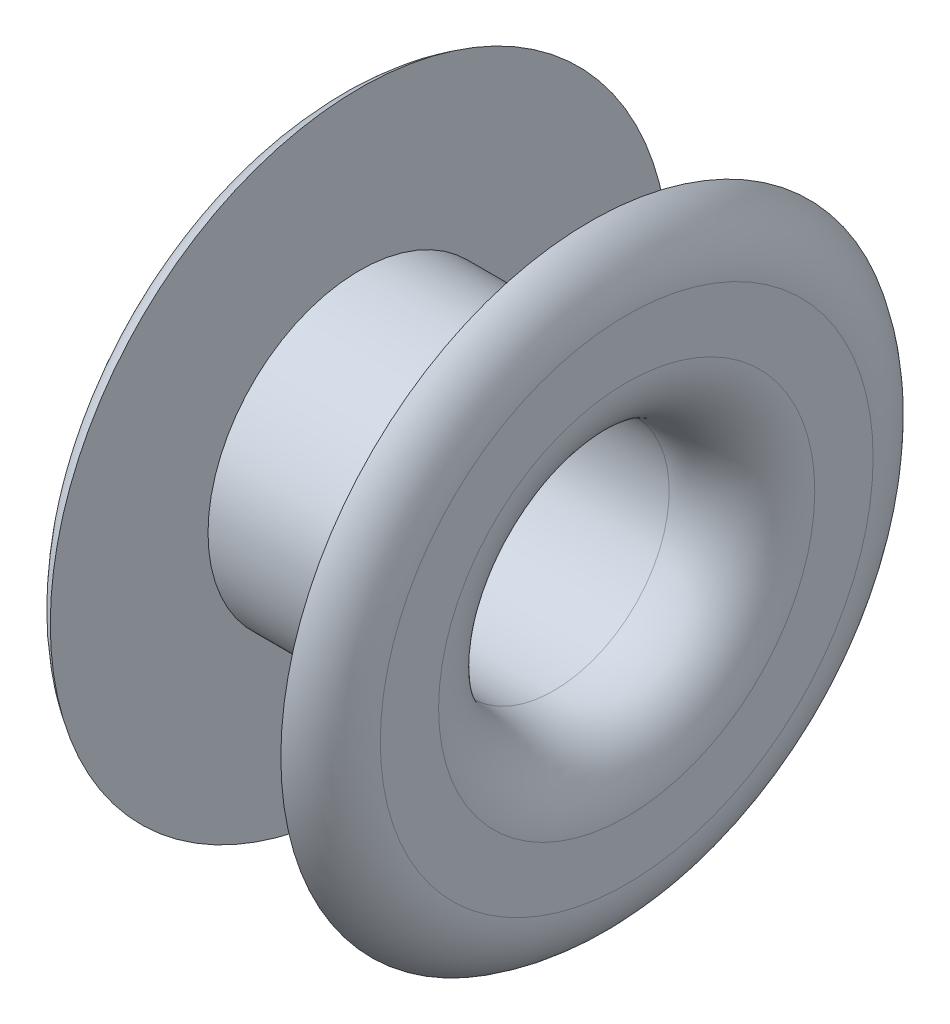
ISO-10303-21;
HEADER;
FILE_DESCRIPTION(('STEP AP214'),'2;1');
FILE_NAME('part.step','',(''),(''),'','','');
FILE_SCHEMA(('AUTOMOTIVE_DESIGN { 1 0 10303 214 1 1 1 1 }'));
ENDSEC;
DATA;
#1=APPLICATION_CONTEXT('core data for automotive mechanical design processes');
#2=APPLICATION_PROTOCOL_DEFINITION('international standard','automotive_design',2000,#1);
#3=PRODUCT_CONTEXT('',#1,'mechanical');
#4=PRODUCT('Part','Part','',(#3));
#5=PRODUCT_RELATED_PRODUCT_CATEGORY('part','',(#4));
#6=PRODUCT_DEFINITION_FORMATION('','',#4);
#7=PRODUCT_DEFINITION_CONTEXT('part definition',#1,'design');
#8=PRODUCT_DEFINITION('design','',#6,#7);
#9=PRODUCT_DEFINITION_SHAPE('','',#8);
#10=(LENGTH_UNIT() NAMED_UNIT(*) SI_UNIT(.MILLI.,.METRE.));
#11=(NAMED_UNIT(*) PLANE_ANGLE_UNIT() SI_UNIT($,.RADIAN.));
#12=(NAMED_UNIT(*) SI_UNIT($,.STERADIAN.) SOLID_ANGLE_UNIT());
#13=UNCERTAINTY_MEASURE_WITH_UNIT(LENGTH_MEASURE(1.E-05),#10,'distance_accuracy_value','');
#14=(GEOMETRIC_REPRESENTATION_CONTEXT(3) GLOBAL_UNCERTAINTY_ASSIGNED_CONTEXT((#13)) GLOBAL_UNIT_ASSIGNED_CONTEXT((#10,
#11,#12)) REPRESENTATION_CONTEXT('',''));
#15=CARTESIAN_POINT('',(0.,0.,0.));
#16=DIRECTION('',(0.,0.,1.));
#17=DIRECTION('',(1.,0.,0.));
#18=AXIS2_PLACEMENT_3D('',#15,#16,#17);
#19=CARTESIAN_POINT('',(-0.65,0.,0.));
#20=DIRECTION('',(-1.,0.,0.));
#21=DIRECTION('',(0.,0.,1.));
#22=AXIS2_PLACEMENT_3D('',#19,#20,#21);
#23=TOROIDAL_SURFACE('',#22,2.03038475772934,0.6);
#24=CARTESIAN_POINT('',(-1.25,0.,0.));
#25=DIRECTION('',(-1.,0.,0.));
#26=DIRECTION('',(0.,0.,-1.));
#27=AXIS2_PLACEMENT_3D('',#24,#25,#26);
#28=CIRCLE('',#27,2.03038475772934);
#29=CARTESIAN_POINT('',(-1.25,0.,-2.03038475772934));
#30=VERTEX_POINT('',#29);
#31=EDGE_CURVE('E74',#30,#30,#28,.T.);
#32=ORIENTED_EDGE('',*,*,#31,.F.);
#33=EDGE_LOOP('',(#32));
#34=FACE_BOUND('',#33,.T.);
#35=CARTESIAN_POINT('',(-0.95,0.,0.));
#36=DIRECTION('',(-1.,0.,0.));
#37=DIRECTION('',(0.,0.,1.));
#38=AXIS2_PLACEMENT_3D('',#35,#36,#37);
#39=CIRCLE('',#38,2.55);
#40=CARTESIAN_POINT('',(-0.95,0.,2.55));
#41=VERTEX_POINT('',#40);
#42=EDGE_CURVE('E75',#41,#41,#39,.T.);
#43=ORIENTED_EDGE('',*,*,#42,.T.);
#44=EDGE_LOOP('',(#43));
#45=FACE_BOUND('',#44,.T.);
#46=ADVANCED_FACE('F16',(#34,#45),#23,.T.);
#47=CARTESIAN_POINT('',(0.65,0.,0.));
#48=DIRECTION('',(-1.,0.,0.));
#49=DIRECTION('',(0.,0.,1.));
#50=AXIS2_PLACEMENT_3D('',#47,#48,#49);
#51=TOROIDAL_SURFACE('',#50,1.55,0.6);
#52=CARTESIAN_POINT('',(1.25,0.,0.));
#53=DIRECTION('',(-1.,0.,0.));
#54=DIRECTION('',(0.,0.,1.));
#55=AXIS2_PLACEMENT_3D('',#52,#53,#54);
#56=CIRCLE('',#55,1.55);
#57=CARTESIAN_POINT('',(1.25,0.,1.55));
#58=VERTEX_POINT('',#57);
#59=EDGE_CURVE('E90',#58,#58,#56,.T.);
#60=ORIENTED_EDGE('',*,*,#59,.F.);
#61=EDGE_LOOP('',(#60));
#62=FACE_BOUND('',#61,.T.);
#63=CARTESIAN_POINT('',(0.65,0.,0.));
#64=DIRECTION('',(1.,0.,0.));
#65=DIRECTION('',(0.,0.,1.));
#66=AXIS2_PLACEMENT_3D('',#63,#64,#65);
#67=CIRCLE('',#66,0.95);
#68=CARTESIAN_POINT('',(0.65,0.,0.95));
#69=VERTEX_POINT('',#68);
#70=EDGE_CURVE('E91',#69,#69,#67,.T.);
#71=ORIENTED_EDGE('',*,*,#70,.F.);
#72=EDGE_LOOP('',(#71));
#73=FACE_BOUND('',#72,.T.);
#74=ADVANCED_FACE('F18',(#62,#73),#51,.T.);
#75=CARTESIAN_POINT('',(-0.65,0.,0.));
#76=DIRECTION('',(1.,0.,0.));
#77=DIRECTION('',(0.,0.,-1.));
#78=AXIS2_PLACEMENT_3D('',#75,#76,#77);
#79=TOROIDAL_SURFACE('',#78,1.55,0.6);
#80=CARTESIAN_POINT('',(-0.65,0.,0.));
#81=DIRECTION('',(-1.,0.,0.));
#82=DIRECTION('',(0.,0.,-1.));
#83=AXIS2_PLACEMENT_3D('',#80,#81,#82);
#84=CIRCLE('',#83,0.95);
#85=CARTESIAN_POINT('',(-0.65,0.,-0.95));
#86=VERTEX_POINT('',#85);
#87=EDGE_CURVE('E87',#86,#86,#84,.T.);
#88=ORIENTED_EDGE('',*,*,#87,.F.);
#89=EDGE_LOOP('',(#88));
#90=FACE_BOUND('',#89,.T.);
#91=CARTESIAN_POINT('',(-1.25,0.,0.));
#92=DIRECTION('',(1.,0.,0.));
#93=DIRECTION('',(0.,0.,-1.));
#94=AXIS2_PLACEMENT_3D('',#91,#92,#93);
#95=CIRCLE('',#94,1.55);
#96=CARTESIAN_POINT('',(-1.25,0.,-1.55));
#97=VERTEX_POINT('',#96);
#98=EDGE_CURVE('E82',#97,#97,#95,.T.);
#99=ORIENTED_EDGE('',*,*,#98,.F.);
#100=EDGE_LOOP('',(#99));
#101=FACE_BOUND('',#100,.T.);
#102=ADVANCED_FACE('F116',(#90,#101),#79,.T.);
#103=CARTESIAN_POINT('',(0.65,0.,0.));
#104=DIRECTION('',(1.,0.,0.));
#105=DIRECTION('',(0.,0.,-1.));
#106=AXIS2_PLACEMENT_3D('',#103,#104,#105);
#107=TOROIDAL_SURFACE('',#106,2.03038475772934,0.6);
#108=CARTESIAN_POINT('',(0.95,0.,0.));
#109=DIRECTION('',(-1.,0.,0.));
#110=DIRECTION('',(0.,0.,1.));
#111=AXIS2_PLACEMENT_3D('',#108,#109,#110);
#112=CIRCLE('',#111,2.55);
#113=CARTESIAN_POINT('',(0.95,0.,2.55));
#114=VERTEX_POINT('',#113);
#115=EDGE_CURVE('E11',#114,#114,#112,.T.);
#116=ORIENTED_EDGE('',*,*,#115,.F.);
#117=EDGE_LOOP('',(#116));
#118=FACE_BOUND('',#117,.T.);
#119=CARTESIAN_POINT('',(1.25,0.,0.));
#120=DIRECTION('',(1.,0.,0.));
#121=DIRECTION('',(0.,0.,1.));
#122=AXIS2_PLACEMENT_3D('',#119,#120,#121);
#123=CIRCLE('',#122,2.03038475772934);
#124=CARTESIAN_POINT('',(1.25,0.,2.03038475772934));
#125=VERTEX_POINT('',#124);
#126=EDGE_CURVE('E95',#125,#125,#123,.T.);
#127=ORIENTED_EDGE('',*,*,#126,.F.);
#128=EDGE_LOOP('',(#127));
#129=FACE_BOUND('',#128,.T.);
#130=ADVANCED_FACE('F118',(#118,#129),#107,.T.);
#131=CARTESIAN_POINT('',(-0.0764724184478094,0.,0.));
#132=DIRECTION('',(-1.,0.,0.));
#133=DIRECTION('',(0.,0.,1.));
#134=AXIS2_PLACEMENT_3D('',#131,#132,#133);
#135=CYLINDRICAL_SURFACE('',#134,1.25);
#136=CARTESIAN_POINT('',(0.95,0.,0.));
#137=DIRECTION('',(-1.,0.,0.));
#138=DIRECTION('',(0.,0.,1.));
#139=AXIS2_PLACEMENT_3D('',#136,#137,#138);
#140=CIRCLE('',#139,1.25);
#141=CARTESIAN_POINT('',(0.95,0.,1.25));
#142=VERTEX_POINT('',#141);
#143=EDGE_CURVE('E26',#142,#142,#140,.T.);
#144=ORIENTED_EDGE('',*,*,#143,.T.);
#145=EDGE_LOOP('',(#144));
#146=FACE_BOUND('',#145,.T.);
#147=CARTESIAN_POINT('',(-0.95,0.,0.));
#148=DIRECTION('',(-1.,0.,0.));
#149=DIRECTION('',(0.,0.,1.));
#150=AXIS2_PLACEMENT_3D('',#147,#148,#149);
#151=CIRCLE('',#150,1.25);
#152=CARTESIAN_POINT('',(-0.95,0.,1.25));
#153=VERTEX_POINT('',#152);
#154=EDGE_CURVE('E69',#153,#153,#151,.T.);
#155=ORIENTED_EDGE('',*,*,#154,.F.);
#156=EDGE_LOOP('',(#155));
#157=FACE_BOUND('',#156,.T.);
#158=ADVANCED_FACE('F126',(#146,#157),#135,.T.);
#159=CARTESIAN_POINT('',(0.95,1.25,0.));
#160=DIRECTION('',(1.,0.,0.));
#161=DIRECTION('',(0.,1.,0.));
#162=AXIS2_PLACEMENT_3D('',#159,#160,#161);
#163=PLANE('',#162);
#164=ORIENTED_EDGE('',*,*,#115,.T.);
#165=EDGE_LOOP('',(#164));
#166=FACE_BOUND('',#165,.T.);
#167=ORIENTED_EDGE('',*,*,#143,.F.);
#168=EDGE_LOOP('',(#167));
#169=FACE_BOUND('',#168,.T.);
#170=ADVANCED_FACE('F142',(#166,#169),#163,.F.);
#171=CARTESIAN_POINT('',(1.25,2.55,0.));
#172=DIRECTION('',(-1.,0.,0.));
#173=DIRECTION('',(0.,0.,1.));
#174=AXIS2_PLACEMENT_3D('',#171,#172,#173);
#175=PLANE('',#174);
#176=ORIENTED_EDGE('',*,*,#126,.T.);
#177=EDGE_LOOP('',(#176));
#178=FACE_BOUND('',#177,.T.);
#179=ORIENTED_EDGE('',*,*,#59,.T.);
#180=EDGE_LOOP('',(#179));
#181=FACE_BOUND('',#180,.T.);
#182=ADVANCED_FACE('F145',(#178,#181),#175,.F.);
#183=CARTESIAN_POINT('',(-0.0764724184478094,0.,0.));
#184=DIRECTION('',(-1.,0.,0.));
#185=DIRECTION('',(0.,0.,1.));
#186=AXIS2_PLACEMENT_3D('',#183,#184,#185);
#187=CYLINDRICAL_SURFACE('',#186,0.95);
#188=ORIENTED_EDGE('',*,*,#87,.T.);
#189=EDGE_LOOP('',(#188));
#190=FACE_BOUND('',#189,.T.);
#191=ORIENTED_EDGE('',*,*,#70,.T.);
#192=EDGE_LOOP('',(#191));
#193=FACE_BOUND('',#192,.T.);
#194=ADVANCED_FACE('F146',(#190,#193),#187,.F.);
#195=CARTESIAN_POINT('',(-1.25,2.55,0.));
#196=DIRECTION('',(1.,0.,0.));
#197=DIRECTION('',(0.,1.,0.));
#198=AXIS2_PLACEMENT_3D('',#195,#196,#197);
#199=PLANE('',#198);
#200=ORIENTED_EDGE('',*,*,#98,.T.);
#201=EDGE_LOOP('',(#200));
#202=FACE_BOUND('',#201,.T.);
#203=ORIENTED_EDGE('',*,*,#31,.T.);
#204=EDGE_LOOP('',(#203));
#205=FACE_BOUND('',#204,.T.);
#206=ADVANCED_FACE('F113',(#202,#205),#199,.F.);
#207=CARTESIAN_POINT('',(-0.95,1.25,0.));
#208=DIRECTION('',(-1.,0.,0.));
#209=DIRECTION('',(0.,0.,1.));
#210=AXIS2_PLACEMENT_3D('',#207,#208,#209);
#211=PLANE('',#210);
#212=ORIENTED_EDGE('',*,*,#154,.T.);
#213=EDGE_LOOP('',(#212));
#214=FACE_BOUND('',#213,.T.);
#215=ORIENTED_EDGE('',*,*,#42,.F.);
#216=EDGE_LOOP('',(#215));
#217=FACE_BOUND('',#216,.T.);
#218=ADVANCED_FACE('F70',(#214,#217),#211,.F.);
#219=CLOSED_SHELL('',(#46,#74,#102,#130,#158,#170,#182,#194,#206,#218));
#220=MANIFOLD_SOLID_BREP('B1',#219);
#221=ADVANCED_BREP_SHAPE_REPRESENTATION('',(#18,#220),#14);
#222=SHAPE_DEFINITION_REPRESENTATION(#9,#221);
ENDSEC;
END-ISO-10303-21;
